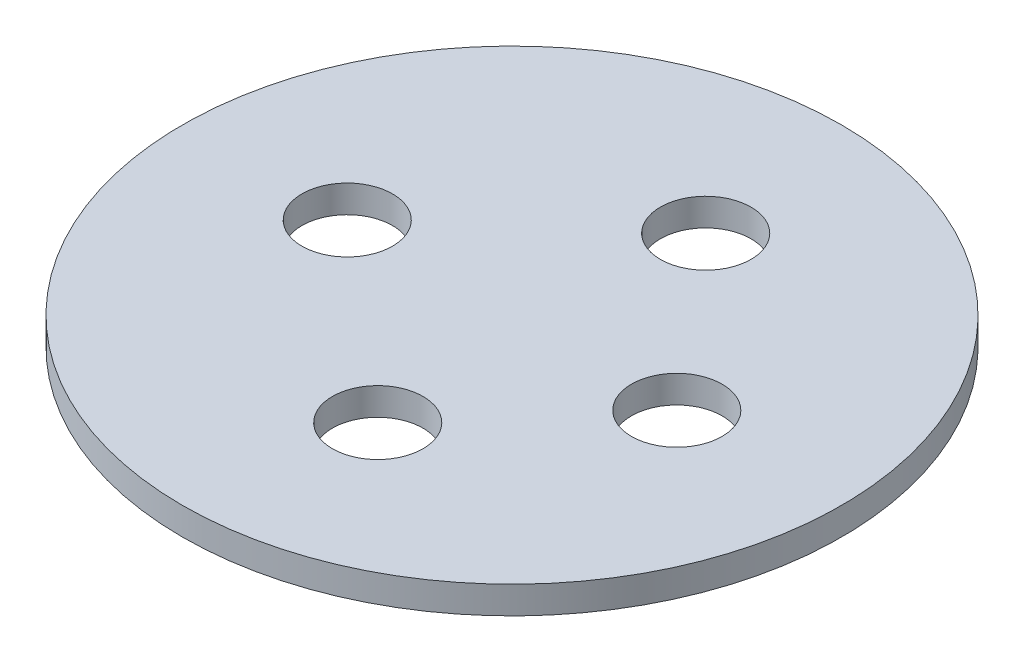
ISO-10303-21;
HEADER;
FILE_DESCRIPTION(('STEP AP214'),'2;1');
FILE_NAME('part.step','',(''),(''),'','','');
FILE_SCHEMA(('AUTOMOTIVE_DESIGN { 1 0 10303 214 1 1 1 1 }'));
ENDSEC;
DATA;
#1=APPLICATION_CONTEXT('core data for automotive mechanical design processes');
#2=APPLICATION_PROTOCOL_DEFINITION('international standard','automotive_design',2000,#1);
#3=PRODUCT_CONTEXT('',#1,'mechanical');
#4=PRODUCT('Part','Part','',(#3));
#5=PRODUCT_RELATED_PRODUCT_CATEGORY('part','',(#4));
#6=PRODUCT_DEFINITION_FORMATION('','',#4);
#7=PRODUCT_DEFINITION_CONTEXT('part definition',#1,'design');
#8=PRODUCT_DEFINITION('design','',#6,#7);
#9=PRODUCT_DEFINITION_SHAPE('','',#8);
#10=(LENGTH_UNIT() NAMED_UNIT(*) SI_UNIT(.MILLI.,.METRE.));
#11=(NAMED_UNIT(*) PLANE_ANGLE_UNIT() SI_UNIT($,.RADIAN.));
#12=(NAMED_UNIT(*) SI_UNIT($,.STERADIAN.) SOLID_ANGLE_UNIT());
#13=UNCERTAINTY_MEASURE_WITH_UNIT(LENGTH_MEASURE(1.E-05),#10,'distance_accuracy_value','');
#14=(GEOMETRIC_REPRESENTATION_CONTEXT(3) GLOBAL_UNCERTAINTY_ASSIGNED_CONTEXT((#13)) GLOBAL_UNIT_ASSIGNED_CONTEXT((#10,
#11,#12)) REPRESENTATION_CONTEXT('',''));
#15=CARTESIAN_POINT('',(0.,0.,0.));
#16=DIRECTION('',(0.,0.,1.));
#17=DIRECTION('',(1.,0.,0.));
#18=AXIS2_PLACEMENT_3D('',#15,#16,#17);
#19=CARTESIAN_POINT('',(-1.34521468985177,-1.,-0.946943509392953));
#20=DIRECTION('',(0.,1.,0.));
#21=DIRECTION('',(0.,0.,1.));
#22=AXIS2_PLACEMENT_3D('',#19,#20,#21);
#23=CYLINDRICAL_SURFACE('',#22,12.);
#24=CARTESIAN_POINT('',(-1.34521468985177,-1.,-0.946943509392953));
#25=DIRECTION('',(0.,1.,0.));
#26=DIRECTION('',(0.,0.,1.));
#27=AXIS2_PLACEMENT_3D('',#24,#25,#26);
#28=CIRCLE('',#27,12.);
#29=CARTESIAN_POINT('',(-1.34521468985177,-1.,11.053056490607));
#30=VERTEX_POINT('',#29);
#31=EDGE_CURVE('E10',#30,#30,#28,.T.);
#32=ORIENTED_EDGE('',*,*,#31,.T.);
#33=EDGE_LOOP('',(#32));
#34=FACE_BOUND('',#33,.T.);
#35=CARTESIAN_POINT('',(-1.34521468985177,0.,-0.946943509392953));
#36=DIRECTION('',(0.,1.,0.));
#37=DIRECTION('',(0.,0.,1.));
#38=AXIS2_PLACEMENT_3D('',#35,#36,#37);
#39=CIRCLE('',#38,12.);
#40=CARTESIAN_POINT('',(-1.34521468985177,0.,11.053056490607));
#41=VERTEX_POINT('',#40);
#42=EDGE_CURVE('E42',#41,#41,#39,.T.);
#43=ORIENTED_EDGE('',*,*,#42,.F.);
#44=EDGE_LOOP('',(#43));
#45=FACE_BOUND('',#44,.T.);
#46=ADVANCED_FACE('F41',(#34,#45),#23,.T.);
#47=CARTESIAN_POINT('',(-1.34521468985177,-1.,-0.946943509392953));
#48=DIRECTION('',(0.,1.,0.));
#49=DIRECTION('',(0.,0.,1.));
#50=AXIS2_PLACEMENT_3D('',#47,#48,#49);
#51=PLANE('',#50);
#52=CARTESIAN_POINT('',(-7.34521468985177,-1.,-0.946943509392952));
#53=DIRECTION('',(0.,1.,0.));
#54=DIRECTION('',(0.,0.,1.));
#55=AXIS2_PLACEMENT_3D('',#52,#53,#54);
#56=CIRCLE('',#55,1.65);
#57=CARTESIAN_POINT('',(-7.34521468985177,-1.,0.703056490607048));
#58=VERTEX_POINT('',#57);
#59=EDGE_CURVE('E51',#58,#58,#56,.T.);
#60=ORIENTED_EDGE('',*,*,#59,.T.);
#61=EDGE_LOOP('',(#60));
#62=FACE_BOUND('',#61,.T.);
#63=CARTESIAN_POINT('',(-0.402320715168507,-1.,-7.05643101611057));
#64=DIRECTION('',(0.,1.,0.));
#65=DIRECTION('',(0.,0.,1.));
#66=AXIS2_PLACEMENT_3D('',#63,#64,#65);
#67=CIRCLE('',#66,1.65);
#68=CARTESIAN_POINT('',(-0.402320715168507,-1.,-5.40643101611057));
#69=VERTEX_POINT('',#68);
#70=EDGE_CURVE('E61',#69,#69,#67,.T.);
#71=ORIENTED_EDGE('',*,*,#70,.T.);
#72=EDGE_LOOP('',(#71));
#73=FACE_BOUND('',#72,.T.);
#74=CARTESIAN_POINT('',(-0.402320715168507,-1.,4.88561067159903));
#75=DIRECTION('',(0.,1.,0.));
#76=DIRECTION('',(0.,0.,1.));
#77=AXIS2_PLACEMENT_3D('',#74,#75,#76);
#78=CIRCLE('',#77,1.65);
#79=CARTESIAN_POINT('',(-0.402320715168507,-1.,6.53561067159904));
#80=VERTEX_POINT('',#79);
#81=EDGE_CURVE('E56',#80,#80,#78,.T.);
#82=ORIENTED_EDGE('',*,*,#81,.T.);
#83=EDGE_LOOP('',(#82));
#84=FACE_BOUND('',#83,.T.);
#85=CARTESIAN_POINT('',(4.65478531014823,-1.,-0.946943509392953));
#86=DIRECTION('',(0.,1.,0.));
#87=DIRECTION('',(0.,0.,1.));
#88=AXIS2_PLACEMENT_3D('',#85,#86,#87);
#89=CIRCLE('',#88,1.65);
#90=CARTESIAN_POINT('',(4.65478531014823,-1.,0.703056490607048));
#91=VERTEX_POINT('',#90);
#92=EDGE_CURVE('E52',#91,#91,#89,.T.);
#93=ORIENTED_EDGE('',*,*,#92,.T.);
#94=EDGE_LOOP('',(#93));
#95=FACE_BOUND('',#94,.T.);
#96=ORIENTED_EDGE('',*,*,#31,.F.);
#97=EDGE_LOOP('',(#96));
#98=FACE_BOUND('',#97,.T.);
#99=ADVANCED_FACE('F77',(#62,#73,#84,#95,#98),#51,.F.);
#100=CARTESIAN_POINT('',(-1.34521468985177,0.,-0.946943509392953));
#101=DIRECTION('',(0.,1.,0.));
#102=DIRECTION('',(0.,0.,1.));
#103=AXIS2_PLACEMENT_3D('',#100,#101,#102);
#104=PLANE('',#103);
#105=CARTESIAN_POINT('',(-7.34521468985177,0.,-0.946943509392952));
#106=DIRECTION('',(0.,1.,0.));
#107=DIRECTION('',(0.,0.,1.));
#108=AXIS2_PLACEMENT_3D('',#105,#106,#107);
#109=CIRCLE('',#108,1.65);
#110=CARTESIAN_POINT('',(-7.34521468985177,0.,0.703056490607048));
#111=VERTEX_POINT('',#110);
#112=EDGE_CURVE('E72',#111,#111,#109,.T.);
#113=ORIENTED_EDGE('',*,*,#112,.F.);
#114=EDGE_LOOP('',(#113));
#115=FACE_BOUND('',#114,.T.);
#116=CARTESIAN_POINT('',(-0.402320715168507,0.,-7.05643101611057));
#117=DIRECTION('',(0.,1.,0.));
#118=DIRECTION('',(0.,0.,1.));
#119=AXIS2_PLACEMENT_3D('',#116,#117,#118);
#120=CIRCLE('',#119,1.65);
#121=CARTESIAN_POINT('',(-0.402320715168507,0.,-5.40643101611057));
#122=VERTEX_POINT('',#121);
#123=EDGE_CURVE('E66',#122,#122,#120,.T.);
#124=ORIENTED_EDGE('',*,*,#123,.F.);
#125=EDGE_LOOP('',(#124));
#126=FACE_BOUND('',#125,.T.);
#127=CARTESIAN_POINT('',(-0.402320715168507,0.,4.88561067159903));
#128=DIRECTION('',(0.,1.,0.));
#129=DIRECTION('',(0.,0.,1.));
#130=AXIS2_PLACEMENT_3D('',#127,#128,#129);
#131=CIRCLE('',#130,1.65);
#132=CARTESIAN_POINT('',(-0.402320715168507,0.,6.53561067159904));
#133=VERTEX_POINT('',#132);
#134=EDGE_CURVE('E65',#133,#133,#131,.T.);
#135=ORIENTED_EDGE('',*,*,#134,.F.);
#136=EDGE_LOOP('',(#135));
#137=FACE_BOUND('',#136,.T.);
#138=CARTESIAN_POINT('',(4.65478531014823,0.,-0.946943509392953));
#139=DIRECTION('',(0.,1.,0.));
#140=DIRECTION('',(0.,0.,1.));
#141=AXIS2_PLACEMENT_3D('',#138,#139,#140);
#142=CIRCLE('',#141,1.65);
#143=CARTESIAN_POINT('',(4.65478531014823,0.,0.703056490607048));
#144=VERTEX_POINT('',#143);
#145=EDGE_CURVE('E57',#144,#144,#142,.T.);
#146=ORIENTED_EDGE('',*,*,#145,.F.);
#147=EDGE_LOOP('',(#146));
#148=FACE_BOUND('',#147,.T.);
#149=ORIENTED_EDGE('',*,*,#42,.T.);
#150=EDGE_LOOP('',(#149));
#151=FACE_BOUND('',#150,.T.);
#152=ADVANCED_FACE('F90',(#115,#126,#137,#148,#151),#104,.T.);
#153=CARTESIAN_POINT('',(4.65478531014823,-1.,-0.946943509392953));
#154=DIRECTION('',(0.,1.,0.));
#155=DIRECTION('',(0.,0.,1.));
#156=AXIS2_PLACEMENT_3D('',#153,#154,#155);
#157=CYLINDRICAL_SURFACE('',#156,1.65);
#158=ORIENTED_EDGE('',*,*,#92,.F.);
#159=EDGE_LOOP('',(#158));
#160=FACE_BOUND('',#159,.T.);
#161=ORIENTED_EDGE('',*,*,#145,.T.);
#162=EDGE_LOOP('',(#161));
#163=FACE_BOUND('',#162,.T.);
#164=ADVANCED_FACE('F89',(#160,#163),#157,.F.);
#165=CARTESIAN_POINT('',(-0.402320715168507,-1.,4.88561067159903));
#166=DIRECTION('',(0.,1.,0.));
#167=DIRECTION('',(0.,0.,1.));
#168=AXIS2_PLACEMENT_3D('',#165,#166,#167);
#169=CYLINDRICAL_SURFACE('',#168,1.65);
#170=ORIENTED_EDGE('',*,*,#81,.F.);
#171=EDGE_LOOP('',(#170));
#172=FACE_BOUND('',#171,.T.);
#173=ORIENTED_EDGE('',*,*,#134,.T.);
#174=EDGE_LOOP('',(#173));
#175=FACE_BOUND('',#174,.T.);
#176=ADVANCED_FACE('F109',(#172,#175),#169,.F.);
#177=CARTESIAN_POINT('',(-0.402320715168507,-1.,-7.05643101611057));
#178=DIRECTION('',(0.,1.,0.));
#179=DIRECTION('',(0.,0.,1.));
#180=AXIS2_PLACEMENT_3D('',#177,#178,#179);
#181=CYLINDRICAL_SURFACE('',#180,1.65);
#182=ORIENTED_EDGE('',*,*,#70,.F.);
#183=EDGE_LOOP('',(#182));
#184=FACE_BOUND('',#183,.T.);
#185=ORIENTED_EDGE('',*,*,#123,.T.);
#186=EDGE_LOOP('',(#185));
#187=FACE_BOUND('',#186,.T.);
#188=ADVANCED_FACE('F81',(#184,#187),#181,.F.);
#189=CARTESIAN_POINT('',(-7.34521468985177,-1.,-0.946943509392952));
#190=DIRECTION('',(0.,1.,0.));
#191=DIRECTION('',(0.,0.,1.));
#192=AXIS2_PLACEMENT_3D('',#189,#190,#191);
#193=CYLINDRICAL_SURFACE('',#192,1.65);
#194=ORIENTED_EDGE('',*,*,#59,.F.);
#195=EDGE_LOOP('',(#194));
#196=FACE_BOUND('',#195,.T.);
#197=ORIENTED_EDGE('',*,*,#112,.T.);
#198=EDGE_LOOP('',(#197));
#199=FACE_BOUND('',#198,.T.);
#200=ADVANCED_FACE('F79',(#196,#199),#193,.F.);
#201=CLOSED_SHELL('',(#46,#99,#152,#164,#176,#188,#200));
#202=MANIFOLD_SOLID_BREP('B2',#201);
#203=ADVANCED_BREP_SHAPE_REPRESENTATION('',(#18,#202),#14);
#204=SHAPE_DEFINITION_REPRESENTATION(#9,#203);
ENDSEC;
END-ISO-10303-21;
